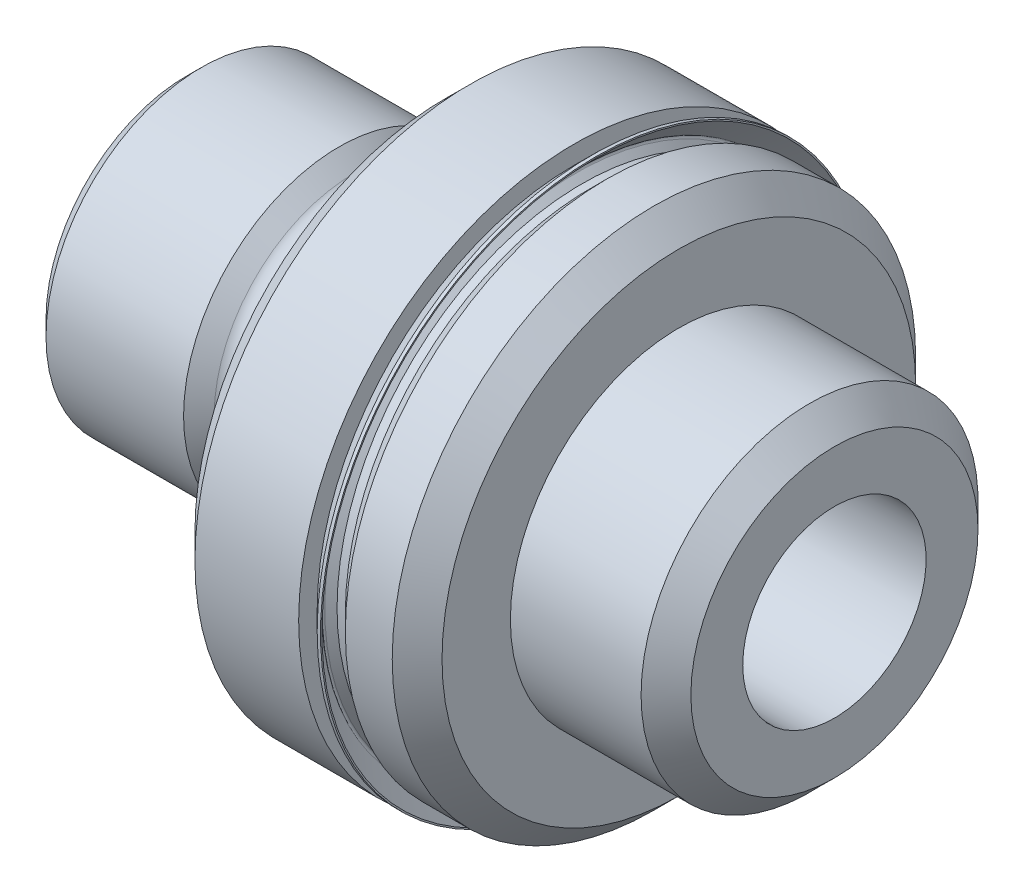
ISO-10303-21;
HEADER;
FILE_DESCRIPTION(('STEP AP214'),'2;1');
FILE_NAME('part.step','',(''),(''),'','','');
FILE_SCHEMA(('AUTOMOTIVE_DESIGN { 1 0 10303 214 1 1 1 1 }'));
ENDSEC;
DATA;
#1=APPLICATION_CONTEXT('core data for automotive mechanical design processes');
#2=APPLICATION_PROTOCOL_DEFINITION('international standard','automotive_design',2000,#1);
#3=PRODUCT_CONTEXT('',#1,'mechanical');
#4=PRODUCT('Part','Part','',(#3));
#5=PRODUCT_RELATED_PRODUCT_CATEGORY('part','',(#4));
#6=PRODUCT_DEFINITION_FORMATION('','',#4);
#7=PRODUCT_DEFINITION_CONTEXT('part definition',#1,'design');
#8=PRODUCT_DEFINITION('design','',#6,#7);
#9=PRODUCT_DEFINITION_SHAPE('','',#8);
#10=(LENGTH_UNIT() NAMED_UNIT(*) SI_UNIT(.MILLI.,.METRE.));
#11=(NAMED_UNIT(*) PLANE_ANGLE_UNIT() SI_UNIT($,.RADIAN.));
#12=(NAMED_UNIT(*) SI_UNIT($,.STERADIAN.) SOLID_ANGLE_UNIT());
#13=UNCERTAINTY_MEASURE_WITH_UNIT(LENGTH_MEASURE(1.E-05),#10,'distance_accuracy_value','');
#14=(GEOMETRIC_REPRESENTATION_CONTEXT(3) GLOBAL_UNCERTAINTY_ASSIGNED_CONTEXT((#13)) GLOBAL_UNIT_ASSIGNED_CONTEXT((#10,
#11,#12)) REPRESENTATION_CONTEXT('',''));
#15=CARTESIAN_POINT('',(0.,0.,0.));
#16=DIRECTION('',(0.,0.,1.));
#17=DIRECTION('',(1.,0.,0.));
#18=AXIS2_PLACEMENT_3D('',#15,#16,#17);
#19=CARTESIAN_POINT('',(23.7236,16.84655,0.));
#20=DIRECTION('',(-1.,0.,0.));
#21=DIRECTION('',(0.,0.,1.));
#22=AXIS2_PLACEMENT_3D('',#19,#20,#21);
#23=PLANE('',#22);
#24=CARTESIAN_POINT('',(23.7236,0.,0.));
#25=DIRECTION('',(-1.,0.,0.));
#26=DIRECTION('',(0.,0.,1.));
#27=AXIS2_PLACEMENT_3D('',#24,#25,#26);
#28=CIRCLE('',#27,16.84655);
#29=CARTESIAN_POINT('',(23.7236,0.,16.84655));
#30=VERTEX_POINT('',#29);
#31=EDGE_CURVE('E85',#30,#30,#28,.T.);
#32=ORIENTED_EDGE('',*,*,#31,.F.);
#33=EDGE_LOOP('',(#32));
#34=FACE_BOUND('',#33,.T.);
#35=CARTESIAN_POINT('',(23.7236,-2.74838938549352E-13,1.61870165610332E-13));
#36=DIRECTION('',(-1.,0.,0.));
#37=DIRECTION('',(0.,0.,1.));
#38=AXIS2_PLACEMENT_3D('',#35,#36,#37);
#39=CIRCLE('',#38,15.7132591752454);
#40=CARTESIAN_POINT('',(23.7236,-2.74838938549352E-13,15.7132591752456));
#41=VERTEX_POINT('',#40);
#42=EDGE_CURVE('E10',#41,#41,#39,.F.);
#43=ORIENTED_EDGE('',*,*,#42,.F.);
#44=EDGE_LOOP('',(#43));
#45=FACE_BOUND('',#44,.T.);
#46=ADVANCED_FACE('F35',(#34,#45),#23,.F.);
#47=CARTESIAN_POINT('',(30.1498,0.,0.));
#48=DIRECTION('',(-1.,0.,0.));
#49=DIRECTION('',(0.,0.,1.));
#50=AXIS2_PLACEMENT_3D('',#47,#48,#49);
#51=CYLINDRICAL_SURFACE('',#50,15.00505);
#52=CARTESIAN_POINT('',(24.7396,0.,0.));
#53=DIRECTION('',(-1.,0.,0.));
#54=DIRECTION('',(0.,0.,1.));
#55=AXIS2_PLACEMENT_3D('',#52,#53,#54);
#56=CIRCLE('',#55,15.00505);
#57=CARTESIAN_POINT('',(24.7396,0.,15.00505));
#58=VERTEX_POINT('',#57);
#59=EDGE_CURVE('E88',#58,#58,#56,.T.);
#60=ORIENTED_EDGE('',*,*,#59,.T.);
#61=EDGE_LOOP('',(#60));
#62=FACE_BOUND('',#61,.T.);
#63=CARTESIAN_POINT('',(24.2316000000001,-2.67896815842051E-13,0.));
#64=DIRECTION('',(-1.,0.,0.));
#65=DIRECTION('',(0.,-1.,0.));
#66=AXIS2_PLACEMENT_3D('',#63,#64,#65);
#67=CIRCLE('',#66,15.00505);
#68=CARTESIAN_POINT('',(24.2315999999999,-15.0050500000003,0.));
#69=VERTEX_POINT('',#68);
#70=EDGE_CURVE('E42',#69,#69,#67,.T.);
#71=ORIENTED_EDGE('',*,*,#70,.F.);
#72=EDGE_LOOP('',(#71));
#73=FACE_BOUND('',#72,.T.);
#74=ADVANCED_FACE('F143',(#62,#73),#51,.T.);
#75=CARTESIAN_POINT('',(30.1498,14.49705,0.));
#76=DIRECTION('',(-1.,0.,0.));
#77=DIRECTION('',(0.,0.,1.));
#78=AXIS2_PLACEMENT_3D('',#75,#76,#77);
#79=PLANE('',#78);
#80=CARTESIAN_POINT('',(30.1498,0.,0.));
#81=DIRECTION('',(-1.,0.,0.));
#82=DIRECTION('',(0.,0.,1.));
#83=AXIS2_PLACEMENT_3D('',#80,#81,#82);
#84=CIRCLE('',#83,14.49705);
#85=CARTESIAN_POINT('',(30.1498,0.,14.49705));
#86=VERTEX_POINT('',#85);
#87=EDGE_CURVE('E97',#86,#86,#84,.T.);
#88=ORIENTED_EDGE('',*,*,#87,.F.);
#89=EDGE_LOOP('',(#88));
#90=FACE_BOUND('',#89,.T.);
#91=CARTESIAN_POINT('',(30.1498,0.,0.));
#92=DIRECTION('',(-1.,0.,0.));
#93=DIRECTION('',(0.,0.,1.));
#94=AXIS2_PLACEMENT_3D('',#91,#92,#93);
#95=CIRCLE('',#94,10.3124);
#96=CARTESIAN_POINT('',(30.1498,0.,10.3124));
#97=VERTEX_POINT('',#96);
#98=EDGE_CURVE('E46',#97,#97,#95,.F.);
#99=ORIENTED_EDGE('',*,*,#98,.F.);
#100=EDGE_LOOP('',(#99));
#101=FACE_BOUND('',#100,.T.);
#102=ADVANCED_FACE('F149',(#90,#101),#79,.F.);
#103=CARTESIAN_POINT('',(15.8496,0.,0.));
#104=DIRECTION('',(-1.,0.,0.));
#105=DIRECTION('',(0.,0.,1.));
#106=AXIS2_PLACEMENT_3D('',#103,#104,#105);
#107=CYLINDRICAL_SURFACE('',#106,9.49325);
#108=CARTESIAN_POINT('',(13.462,0.,0.));
#109=DIRECTION('',(-1.,0.,0.));
#110=DIRECTION('',(0.,0.,1.));
#111=AXIS2_PLACEMENT_3D('',#108,#109,#110);
#112=CIRCLE('',#111,9.49325);
#113=CARTESIAN_POINT('',(13.462,0.,9.49325));
#114=VERTEX_POINT('',#113);
#115=EDGE_CURVE('E50',#114,#114,#112,.T.);
#116=ORIENTED_EDGE('',*,*,#115,.F.);
#117=EDGE_LOOP('',(#116));
#118=FACE_BOUND('',#117,.T.);
#119=CARTESIAN_POINT('',(15.8496,0.,0.));
#120=DIRECTION('',(1.,0.,0.));
#121=DIRECTION('',(0.,0.,-1.));
#122=AXIS2_PLACEMENT_3D('',#119,#120,#121);
#123=CIRCLE('',#122,9.49325);
#124=CARTESIAN_POINT('',(15.8496,0.,-9.49325));
#125=VERTEX_POINT('',#124);
#126=EDGE_CURVE('E76',#125,#125,#123,.T.);
#127=ORIENTED_EDGE('',*,*,#126,.F.);
#128=EDGE_LOOP('',(#127));
#129=FACE_BOUND('',#128,.T.);
#130=ADVANCED_FACE('F37',(#118,#129),#107,.T.);
#131=CARTESIAN_POINT('',(13.462,9.31544999999926,0.));
#132=DIRECTION('',(1.,0.,0.));
#133=DIRECTION('',(0.,0.,-1.));
#134=AXIS2_PLACEMENT_3D('',#131,#132,#133);
#135=PLANE('',#134);
#136=CARTESIAN_POINT('',(13.462,0.,0.));
#137=DIRECTION('',(-1.,0.,0.));
#138=DIRECTION('',(0.,0.,1.));
#139=AXIS2_PLACEMENT_3D('',#136,#137,#138);
#140=CIRCLE('',#139,9.31544999999926);
#141=CARTESIAN_POINT('',(13.462,0.,9.31544999999926));
#142=VERTEX_POINT('',#141);
#143=EDGE_CURVE('E55',#142,#142,#140,.T.);
#144=ORIENTED_EDGE('',*,*,#143,.F.);
#145=EDGE_LOOP('',(#144));
#146=FACE_BOUND('',#145,.T.);
#147=ORIENTED_EDGE('',*,*,#115,.T.);
#148=EDGE_LOOP('',(#147));
#149=FACE_BOUND('',#148,.T.);
#150=ADVANCED_FACE('F195',(#146,#149),#135,.F.);
#151=CARTESIAN_POINT('',(12.4460000000007,0.,0.));
#152=DIRECTION('',(-1.,0.,0.));
#153=DIRECTION('',(0.,0.,1.));
#154=AXIS2_PLACEMENT_3D('',#151,#152,#153);
#155=TOROIDAL_SURFACE('',#154,9.31544999999926,1.01599999999926);
#156=CARTESIAN_POINT('',(12.4460000000007,0.,0.));
#157=DIRECTION('',(-1.,0.,0.));
#158=DIRECTION('',(0.,0.,1.));
#159=AXIS2_PLACEMENT_3D('',#156,#157,#158);
#160=CIRCLE('',#159,8.29945);
#161=CARTESIAN_POINT('',(12.4460000000007,0.,8.29945));
#162=VERTEX_POINT('',#161);
#163=EDGE_CURVE('E58',#162,#162,#160,.T.);
#164=ORIENTED_EDGE('',*,*,#163,.F.);
#165=EDGE_LOOP('',(#164));
#166=FACE_BOUND('',#165,.T.);
#167=ORIENTED_EDGE('',*,*,#143,.T.);
#168=EDGE_LOOP('',(#167));
#169=FACE_BOUND('',#168,.T.);
#170=ADVANCED_FACE('F192',(#166,#169),#155,.F.);
#171=CARTESIAN_POINT('',(15.8496,0.,0.));
#172=DIRECTION('',(-1.,0.,0.));
#173=DIRECTION('',(0.,0.,1.));
#174=AXIS2_PLACEMENT_3D('',#171,#172,#173);
#175=CYLINDRICAL_SURFACE('',#174,8.29945);
#176=CARTESIAN_POINT('',(11.0109,0.,0.));
#177=DIRECTION('',(-1.,0.,0.));
#178=DIRECTION('',(0.,0.,1.));
#179=AXIS2_PLACEMENT_3D('',#176,#177,#178);
#180=CIRCLE('',#179,8.29945);
#181=CARTESIAN_POINT('',(11.0109,0.,8.29945));
#182=VERTEX_POINT('',#181);
#183=EDGE_CURVE('E61',#182,#182,#180,.T.);
#184=ORIENTED_EDGE('',*,*,#183,.F.);
#185=EDGE_LOOP('',(#184));
#186=FACE_BOUND('',#185,.T.);
#187=ORIENTED_EDGE('',*,*,#163,.T.);
#188=EDGE_LOOP('',(#187));
#189=FACE_BOUND('',#188,.T.);
#190=ADVANCED_FACE('F188',(#186,#189),#175,.T.);
#191=CARTESIAN_POINT('',(11.0109000000002,0.,0.));
#192=DIRECTION('',(-1.,0.,0.));
#193=DIRECTION('',(0.,0.,1.));
#194=AXIS2_PLACEMENT_3D('',#191,#192,#193);
#195=TOROIDAL_SURFACE('',#194,9.31544999999971,1.01599999999971);
#196=CARTESIAN_POINT('',(10.2955719352921,0.,0.));
#197=DIRECTION('',(-1.,0.,0.));
#198=DIRECTION('',(0.,0.,1.));
#199=AXIS2_PLACEMENT_3D('',#196,#197,#198);
#200=CIRCLE('',#199,8.59395033968067);
#201=CARTESIAN_POINT('',(10.2955719352921,0.,8.59395033968067));
#202=VERTEX_POINT('',#201);
#203=EDGE_CURVE('E64',#202,#202,#200,.T.);
#204=ORIENTED_EDGE('',*,*,#203,.F.);
#205=EDGE_LOOP('',(#204));
#206=FACE_BOUND('',#205,.T.);
#207=ORIENTED_EDGE('',*,*,#183,.T.);
#208=EDGE_LOOP('',(#207));
#209=FACE_BOUND('',#208,.T.);
#210=ADVANCED_FACE('F184',(#206,#209),#195,.F.);
#211=CARTESIAN_POINT('',(10.2955719352921,0.,0.));
#212=DIRECTION('',(-1.,0.,0.));
#213=DIRECTION('',(0.,0.,1.));
#214=AXIS2_PLACEMENT_3D('',#211,#212,#213);
#215=CONICAL_SURFACE('',#214,8.59395033968067,0.781102897131641);
#216=CARTESIAN_POINT('',(9.3564895103145,0.,0.));
#217=DIRECTION('',(-1.,0.,0.));
#218=DIRECTION('',(0.,0.,1.));
#219=AXIS2_PLACEMENT_3D('',#216,#217,#218);
#220=CIRCLE('',#219,9.525);
#221=CARTESIAN_POINT('',(9.3564895103145,0.,9.525));
#222=VERTEX_POINT('',#221);
#223=EDGE_CURVE('E67',#222,#222,#220,.T.);
#224=ORIENTED_EDGE('',*,*,#223,.F.);
#225=EDGE_LOOP('',(#224));
#226=FACE_BOUND('',#225,.T.);
#227=ORIENTED_EDGE('',*,*,#203,.T.);
#228=EDGE_LOOP('',(#227));
#229=FACE_BOUND('',#228,.T.);
#230=ADVANCED_FACE('F180',(#226,#229),#215,.T.);
#231=CARTESIAN_POINT('',(15.8496,0.,0.));
#232=DIRECTION('',(-1.,0.,0.));
#233=DIRECTION('',(0.,0.,1.));
#234=AXIS2_PLACEMENT_3D('',#231,#232,#233);
#235=CYLINDRICAL_SURFACE('',#234,9.525);
#236=CARTESIAN_POINT('',(0.935989999999999,0.,0.));
#237=DIRECTION('',(-1.,0.,0.));
#238=DIRECTION('',(0.,0.,1.));
#239=AXIS2_PLACEMENT_3D('',#236,#237,#238);
#240=CIRCLE('',#239,9.525);
#241=CARTESIAN_POINT('',(0.935989999999999,0.,9.525));
#242=VERTEX_POINT('',#241);
#243=EDGE_CURVE('E70',#242,#242,#240,.T.);
#244=ORIENTED_EDGE('',*,*,#243,.F.);
#245=EDGE_LOOP('',(#244));
#246=FACE_BOUND('',#245,.T.);
#247=ORIENTED_EDGE('',*,*,#223,.T.);
#248=EDGE_LOOP('',(#247));
#249=FACE_BOUND('',#248,.T.);
#250=ADVANCED_FACE('F176',(#246,#249),#235,.T.);
#251=CARTESIAN_POINT('',(0.935989999999999,0.,0.));
#252=DIRECTION('',(1.,0.,0.));
#253=DIRECTION('',(0.,0.,-1.));
#254=AXIS2_PLACEMENT_3D('',#251,#252,#253);
#255=CONICAL_SURFACE('',#254,9.525,0.785398163397449);
#256=CARTESIAN_POINT('',(0.,0.,0.));
#257=DIRECTION('',(-1.,0.,0.));
#258=DIRECTION('',(0.,0.,1.));
#259=AXIS2_PLACEMENT_3D('',#256,#257,#258);
#260=CIRCLE('',#259,8.58901);
#261=CARTESIAN_POINT('',(0.,0.,8.58901));
#262=VERTEX_POINT('',#261);
#263=EDGE_CURVE('E73',#262,#262,#260,.T.);
#264=ORIENTED_EDGE('',*,*,#263,.F.);
#265=EDGE_LOOP('',(#264));
#266=FACE_BOUND('',#265,.T.);
#267=ORIENTED_EDGE('',*,*,#243,.T.);
#268=EDGE_LOOP('',(#267));
#269=FACE_BOUND('',#268,.T.);
#270=ADVANCED_FACE('F172',(#266,#269),#255,.T.);
#271=CARTESIAN_POINT('',(0.,0.,0.));
#272=DIRECTION('',(1.,0.,0.));
#273=DIRECTION('',(0.,0.,-1.));
#274=AXIS2_PLACEMENT_3D('',#271,#272,#273);
#275=PLANE('',#274);
#276=CARTESIAN_POINT('',(0.,0.,0.));
#277=DIRECTION('',(-1.,0.,0.));
#278=DIRECTION('',(0.,0.,1.));
#279=AXIS2_PLACEMENT_3D('',#276,#277,#278);
#280=CIRCLE('',#279,6.3754);
#281=CARTESIAN_POINT('',(0.,0.,6.3754));
#282=VERTEX_POINT('',#281);
#283=EDGE_CURVE('E112',#282,#282,#280,.T.);
#284=ORIENTED_EDGE('',*,*,#283,.F.);
#285=EDGE_LOOP('',(#284));
#286=FACE_BOUND('',#285,.T.);
#287=ORIENTED_EDGE('',*,*,#263,.T.);
#288=EDGE_LOOP('',(#287));
#289=FACE_BOUND('',#288,.T.);
#290=ADVANCED_FACE('F168',(#286,#289),#275,.F.);
#291=CARTESIAN_POINT('',(15.8496,0.,0.));
#292=DIRECTION('',(1.,0.,0.));
#293=DIRECTION('',(0.,0.,-1.));
#294=AXIS2_PLACEMENT_3D('',#291,#292,#293);
#295=PLANE('',#294);
#296=CARTESIAN_POINT('',(15.8496,0.,0.));
#297=DIRECTION('',(-1.,0.,0.));
#298=DIRECTION('',(0.,0.,1.));
#299=AXIS2_PLACEMENT_3D('',#296,#297,#298);
#300=CIRCLE('',#299,15.32255);
#301=CARTESIAN_POINT('',(15.8496,0.,15.32255));
#302=VERTEX_POINT('',#301);
#303=EDGE_CURVE('E79',#302,#302,#300,.T.);
#304=ORIENTED_EDGE('',*,*,#303,.T.);
#305=EDGE_LOOP('',(#304));
#306=FACE_BOUND('',#305,.T.);
#307=ORIENTED_EDGE('',*,*,#126,.T.);
#308=EDGE_LOOP('',(#307));
#309=FACE_BOUND('',#308,.T.);
#310=ADVANCED_FACE('F164',(#306,#309),#295,.F.);
#311=CARTESIAN_POINT('',(17.3736,0.,0.));
#312=DIRECTION('',(1.,0.,0.));
#313=DIRECTION('',(0.,0.,-1.));
#314=AXIS2_PLACEMENT_3D('',#311,#312,#313);
#315=CONICAL_SURFACE('',#314,16.84655,0.78539816339745);
#316=ORIENTED_EDGE('',*,*,#303,.F.);
#317=EDGE_LOOP('',(#316));
#318=FACE_BOUND('',#317,.T.);
#319=CARTESIAN_POINT('',(17.3736,0.,0.));
#320=DIRECTION('',(-1.,0.,0.));
#321=DIRECTION('',(0.,0.,1.));
#322=AXIS2_PLACEMENT_3D('',#319,#320,#321);
#323=CIRCLE('',#322,16.84655);
#324=CARTESIAN_POINT('',(17.3736,0.,16.84655));
#325=VERTEX_POINT('',#324);
#326=EDGE_CURVE('E82',#325,#325,#323,.T.);
#327=ORIENTED_EDGE('',*,*,#326,.T.);
#328=EDGE_LOOP('',(#327));
#329=FACE_BOUND('',#328,.T.);
#330=ADVANCED_FACE('F160',(#318,#329),#315,.T.);
#331=CARTESIAN_POINT('',(30.1498,0.,0.));
#332=DIRECTION('',(-1.,0.,0.));
#333=DIRECTION('',(0.,0.,1.));
#334=AXIS2_PLACEMENT_3D('',#331,#332,#333);
#335=CYLINDRICAL_SURFACE('',#334,16.84655);
#336=ORIENTED_EDGE('',*,*,#326,.F.);
#337=EDGE_LOOP('',(#336));
#338=FACE_BOUND('',#337,.T.);
#339=ORIENTED_EDGE('',*,*,#31,.T.);
#340=EDGE_LOOP('',(#339));
#341=FACE_BOUND('',#340,.T.);
#342=ADVANCED_FACE('F156',(#338,#341),#335,.T.);
#343=CARTESIAN_POINT('',(25.7556,0.,0.));
#344=DIRECTION('',(1.,0.,0.));
#345=DIRECTION('',(0.,0.,-1.));
#346=AXIS2_PLACEMENT_3D('',#343,#344,#345);
#347=CONICAL_SURFACE('',#346,16.02105,0.785398163397448);
#348=ORIENTED_EDGE('',*,*,#59,.F.);
#349=EDGE_LOOP('',(#348));
#350=FACE_BOUND('',#349,.T.);
#351=CARTESIAN_POINT('',(25.7556,0.,0.));
#352=DIRECTION('',(-1.,0.,0.));
#353=DIRECTION('',(0.,0.,1.));
#354=AXIS2_PLACEMENT_3D('',#351,#352,#353);
#355=CIRCLE('',#354,16.02105);
#356=CARTESIAN_POINT('',(25.7556,0.,16.02105));
#357=VERTEX_POINT('',#356);
#358=EDGE_CURVE('E91',#357,#357,#355,.T.);
#359=ORIENTED_EDGE('',*,*,#358,.T.);
#360=EDGE_LOOP('',(#359));
#361=FACE_BOUND('',#360,.T.);
#362=ADVANCED_FACE('F159',(#350,#361),#347,.T.);
#363=CARTESIAN_POINT('',(30.1498,0.,0.));
#364=DIRECTION('',(-1.,0.,0.));
#365=DIRECTION('',(0.,0.,1.));
#366=AXIS2_PLACEMENT_3D('',#363,#364,#365);
#367=CYLINDRICAL_SURFACE('',#366,16.02105);
#368=ORIENTED_EDGE('',*,*,#358,.F.);
#369=EDGE_LOOP('',(#368));
#370=FACE_BOUND('',#369,.T.);
#371=CARTESIAN_POINT('',(28.6258,0.,0.));
#372=DIRECTION('',(-1.,0.,0.));
#373=DIRECTION('',(0.,0.,1.));
#374=AXIS2_PLACEMENT_3D('',#371,#372,#373);
#375=CIRCLE('',#374,16.02105);
#376=CARTESIAN_POINT('',(28.6258,0.,16.02105));
#377=VERTEX_POINT('',#376);
#378=EDGE_CURVE('E94',#377,#377,#375,.T.);
#379=ORIENTED_EDGE('',*,*,#378,.T.);
#380=EDGE_LOOP('',(#379));
#381=FACE_BOUND('',#380,.T.);
#382=ADVANCED_FACE('F226',(#370,#381),#367,.T.);
#383=CARTESIAN_POINT('',(30.1498,0.,0.));
#384=DIRECTION('',(-1.,0.,0.));
#385=DIRECTION('',(0.,0.,1.));
#386=AXIS2_PLACEMENT_3D('',#383,#384,#385);
#387=CONICAL_SURFACE('',#386,14.49705,0.785398163397448);
#388=ORIENTED_EDGE('',*,*,#378,.F.);
#389=EDGE_LOOP('',(#388));
#390=FACE_BOUND('',#389,.T.);
#391=ORIENTED_EDGE('',*,*,#87,.T.);
#392=EDGE_LOOP('',(#391));
#393=FACE_BOUND('',#392,.T.);
#394=ADVANCED_FACE('F223',(#390,#393),#387,.T.);
#395=CARTESIAN_POINT('',(39.6748,0.,0.));
#396=DIRECTION('',(-1.,0.,0.));
#397=DIRECTION('',(0.,0.,1.));
#398=AXIS2_PLACEMENT_3D('',#395,#396,#397);
#399=CYLINDRICAL_SURFACE('',#398,10.3124);
#400=ORIENTED_EDGE('',*,*,#98,.T.);
#401=EDGE_LOOP('',(#400));
#402=FACE_BOUND('',#401,.T.);
#403=CARTESIAN_POINT('',(38.1508,0.,0.));
#404=DIRECTION('',(-1.,0.,0.));
#405=DIRECTION('',(0.,0.,1.));
#406=AXIS2_PLACEMENT_3D('',#403,#404,#405);
#407=CIRCLE('',#406,10.3124);
#408=CARTESIAN_POINT('',(38.1508,0.,10.3124));
#409=VERTEX_POINT('',#408);
#410=EDGE_CURVE('E100',#409,#409,#407,.T.);
#411=ORIENTED_EDGE('',*,*,#410,.T.);
#412=EDGE_LOOP('',(#411));
#413=FACE_BOUND('',#412,.T.);
#414=ADVANCED_FACE('F221',(#402,#413),#399,.T.);
#415=CARTESIAN_POINT('',(39.6748,0.,0.));
#416=DIRECTION('',(-1.,0.,0.));
#417=DIRECTION('',(0.,0.,1.));
#418=AXIS2_PLACEMENT_3D('',#415,#416,#417);
#419=CONICAL_SURFACE('',#418,8.7884,0.78539816339745);
#420=ORIENTED_EDGE('',*,*,#410,.F.);
#421=EDGE_LOOP('',(#420));
#422=FACE_BOUND('',#421,.T.);
#423=CARTESIAN_POINT('',(39.6748,0.,0.));
#424=DIRECTION('',(-1.,0.,0.));
#425=DIRECTION('',(0.,0.,1.));
#426=AXIS2_PLACEMENT_3D('',#423,#424,#425);
#427=CIRCLE('',#426,8.7884);
#428=CARTESIAN_POINT('',(39.6748,0.,8.7884));
#429=VERTEX_POINT('',#428);
#430=EDGE_CURVE('E103',#429,#429,#427,.T.);
#431=ORIENTED_EDGE('',*,*,#430,.T.);
#432=EDGE_LOOP('',(#431));
#433=FACE_BOUND('',#432,.T.);
#434=ADVANCED_FACE('F261',(#422,#433),#419,.T.);
#435=CARTESIAN_POINT('',(39.6748,8.7884,0.));
#436=DIRECTION('',(-1.,0.,0.));
#437=DIRECTION('',(0.,0.,1.));
#438=AXIS2_PLACEMENT_3D('',#435,#436,#437);
#439=PLANE('',#438);
#440=CARTESIAN_POINT('',(39.6748,0.,0.));
#441=DIRECTION('',(-1.,0.,0.));
#442=DIRECTION('',(0.,0.,1.));
#443=AXIS2_PLACEMENT_3D('',#440,#441,#442);
#444=CIRCLE('',#443,5.6134);
#445=CARTESIAN_POINT('',(39.6748,0.,5.6134));
#446=VERTEX_POINT('',#445);
#447=EDGE_CURVE('E106',#446,#446,#444,.T.);
#448=ORIENTED_EDGE('',*,*,#447,.T.);
#449=EDGE_LOOP('',(#448));
#450=FACE_BOUND('',#449,.T.);
#451=ORIENTED_EDGE('',*,*,#430,.F.);
#452=EDGE_LOOP('',(#451));
#453=FACE_BOUND('',#452,.T.);
#454=ADVANCED_FACE('F269',(#450,#453),#439,.F.);
#455=CARTESIAN_POINT('',(0.,0.,0.));
#456=DIRECTION('',(-1.,0.,0.));
#457=DIRECTION('',(0.,0.,1.));
#458=AXIS2_PLACEMENT_3D('',#455,#456,#457);
#459=CYLINDRICAL_SURFACE('',#458,5.6134);
#460=ORIENTED_EDGE('',*,*,#447,.F.);
#461=EDGE_LOOP('',(#460));
#462=FACE_BOUND('',#461,.T.);
#463=CARTESIAN_POINT('',(0.761999999999992,0.,0.));
#464=DIRECTION('',(-1.,0.,0.));
#465=DIRECTION('',(0.,0.,1.));
#466=AXIS2_PLACEMENT_3D('',#463,#464,#465);
#467=CIRCLE('',#466,5.61340000000001);
#468=CARTESIAN_POINT('',(0.761999999999992,0.,5.61340000000001));
#469=VERTEX_POINT('',#468);
#470=EDGE_CURVE('E109',#469,#469,#467,.T.);
#471=ORIENTED_EDGE('',*,*,#470,.T.);
#472=EDGE_LOOP('',(#471));
#473=FACE_BOUND('',#472,.T.);
#474=ADVANCED_FACE('F276',(#462,#473),#459,.F.);
#475=CARTESIAN_POINT('',(0.,0.,0.));
#476=DIRECTION('',(-1.,0.,0.));
#477=DIRECTION('',(0.,0.,1.));
#478=AXIS2_PLACEMENT_3D('',#475,#476,#477);
#479=CONICAL_SURFACE('',#478,6.3754,0.785398163397449);
#480=ORIENTED_EDGE('',*,*,#470,.F.);
#481=EDGE_LOOP('',(#480));
#482=FACE_BOUND('',#481,.T.);
#483=ORIENTED_EDGE('',*,*,#283,.T.);
#484=EDGE_LOOP('',(#483));
#485=FACE_BOUND('',#484,.T.);
#486=ADVANCED_FACE('F285',(#482,#485),#479,.F.);
#487=CARTESIAN_POINT('',(24.8568908247548,-2.74838938549352E-13,0.));
#488=DIRECTION('',(1.,0.,0.));
#489=DIRECTION('',(0.,1.,0.));
#490=AXIS2_PLACEMENT_3D('',#487,#488,#489);
#491=CONICAL_SURFACE('',#490,16.8465500000003,0.785398163397461);
#492=ORIENTED_EDGE('',*,*,#42,.T.);
#493=EDGE_LOOP('',(#492));
#494=FACE_BOUND('',#493,.T.);
#495=CARTESIAN_POINT('',(24.8568908247548,-2.74838938549352E-13,0.));
#496=DIRECTION('',(-1.,0.,0.));
#497=DIRECTION('',(0.,-1.,0.));
#498=AXIS2_PLACEMENT_3D('',#495,#496,#497);
#499=CIRCLE('',#498,16.8465500000003);
#500=CARTESIAN_POINT('',(24.8568908247546,-16.8465500000006,0.));
#501=VERTEX_POINT('',#500);
#502=EDGE_CURVE('E115',#501,#501,#499,.T.);
#503=ORIENTED_EDGE('',*,*,#502,.T.);
#504=EDGE_LOOP('',(#503));
#505=FACE_BOUND('',#504,.T.);
#506=ADVANCED_FACE('F293',(#494,#505),#491,.T.);
#507=CARTESIAN_POINT('',(24.7396,-2.7353674880715E-13,0.));
#508=DIRECTION('',(-1.,0.,0.));
#509=DIRECTION('',(0.,-1.,0.));
#510=AXIS2_PLACEMENT_3D('',#507,#508,#509);
#511=CYLINDRICAL_SURFACE('',#510,16.8465500000003);
#512=ORIENTED_EDGE('',*,*,#502,.F.);
#513=EDGE_LOOP('',(#512));
#514=FACE_BOUND('',#513,.T.);
#515=CARTESIAN_POINT('',(25.0600908247548,-2.77094911735392E-13,0.));
#516=DIRECTION('',(-1.,0.,0.));
#517=DIRECTION('',(0.,-1.,0.));
#518=AXIS2_PLACEMENT_3D('',#515,#516,#517);
#519=CIRCLE('',#518,16.8465500000003);
#520=CARTESIAN_POINT('',(25.0600908247546,-16.8465500000006,0.));
#521=VERTEX_POINT('',#520);
#522=EDGE_CURVE('E118',#521,#521,#519,.T.);
#523=ORIENTED_EDGE('',*,*,#522,.T.);
#524=EDGE_LOOP('',(#523));
#525=FACE_BOUND('',#524,.T.);
#526=ADVANCED_FACE('F300',(#514,#525),#511,.T.);
#527=CARTESIAN_POINT('',(25.060090824755,16.762381804126,0.));
#528=DIRECTION('',(-1.,0.,0.));
#529=DIRECTION('',(0.,-1.,0.));
#530=AXIS2_PLACEMENT_3D('',#527,#528,#529);
#531=PLANE('',#530);
#532=ORIENTED_EDGE('',*,*,#522,.F.);
#533=EDGE_LOOP('',(#532));
#534=FACE_BOUND('',#533,.T.);
#535=CARTESIAN_POINT('',(25.0600908247548,-2.77094911735392E-13,0.));
#536=DIRECTION('',(-1.,0.,0.));
#537=DIRECTION('',(0.,-1.,0.));
#538=AXIS2_PLACEMENT_3D('',#535,#536,#537);
#539=CIRCLE('',#538,16.7623818041263);
#540=CARTESIAN_POINT('',(25.0600908247546,-16.7623818041266,0.));
#541=VERTEX_POINT('',#540);
#542=EDGE_CURVE('E121',#541,#541,#539,.T.);
#543=ORIENTED_EDGE('',*,*,#542,.T.);
#544=EDGE_LOOP('',(#543));
#545=FACE_BOUND('',#544,.T.);
#546=ADVANCED_FACE('F308',(#534,#545),#531,.F.);
#547=CARTESIAN_POINT('',(23.8569820715252,-2.63737721345746E-13,0.));
#548=DIRECTION('',(1.,0.,0.));
#549=DIRECTION('',(0.,1.,0.));
#550=AXIS2_PLACEMENT_3D('',#547,#548,#549);
#551=CONICAL_SURFACE('',#550,15.5592730508967,0.785398163397461);
#552=ORIENTED_EDGE('',*,*,#542,.F.);
#553=EDGE_LOOP('',(#552));
#554=FACE_BOUND('',#553,.T.);
#555=CARTESIAN_POINT('',(23.8569820715252,-2.63737721345746E-13,0.));
#556=DIRECTION('',(-1.,0.,0.));
#557=DIRECTION('',(0.,-1.,0.));
#558=AXIS2_PLACEMENT_3D('',#555,#556,#557);
#559=CIRCLE('',#558,15.5592730508967);
#560=CARTESIAN_POINT('',(23.856982071525,-15.5592730508969,0.));
#561=VERTEX_POINT('',#560);
#562=EDGE_CURVE('E124',#561,#561,#559,.T.);
#563=ORIENTED_EDGE('',*,*,#562,.T.);
#564=EDGE_LOOP('',(#563));
#565=FACE_BOUND('',#564,.T.);
#566=ADVANCED_FACE('F139',(#554,#565),#551,.F.);
#567=CARTESIAN_POINT('',(23.9467846327361,-2.65412691824451E-13,0.));
#568=DIRECTION('',(-1.,0.,0.));
#569=DIRECTION('',(0.,-1.,0.));
#570=AXIS2_PLACEMENT_3D('',#567,#568,#569);
#571=TOROIDAL_SURFACE('',#570,15.4694704896858,0.127000000000283);
#572=ORIENTED_EDGE('',*,*,#562,.F.);
#573=EDGE_LOOP('',(#572));
#574=FACE_BOUND('',#573,.T.);
#575=CARTESIAN_POINT('',(23.8569820715252,-2.63737721345746E-13,0.));
#576=DIRECTION('',(-1.,0.,0.));
#577=DIRECTION('',(0.,-1.,0.));
#578=AXIS2_PLACEMENT_3D('',#575,#576,#577);
#579=CIRCLE('',#578,15.3796679284749);
#580=CARTESIAN_POINT('',(23.856982071525,-15.3796679284751,0.));
#581=VERTEX_POINT('',#580);
#582=EDGE_CURVE('E127',#581,#581,#579,.T.);
#583=ORIENTED_EDGE('',*,*,#582,.T.);
#584=EDGE_LOOP('',(#583));
#585=FACE_BOUND('',#584,.T.);
#586=ADVANCED_FACE('F131',(#574,#585),#571,.F.);
#587=CARTESIAN_POINT('',(24.2315999999998,-2.67896815842048E-13,0.));
#588=DIRECTION('',(-1.,0.,0.));
#589=DIRECTION('',(0.,-1.,0.));
#590=AXIS2_PLACEMENT_3D('',#587,#588,#589);
#591=CONICAL_SURFACE('',#590,15.0050500000003,0.785398163397432);
#592=ORIENTED_EDGE('',*,*,#582,.F.);
#593=EDGE_LOOP('',(#592));
#594=FACE_BOUND('',#593,.T.);
#595=ORIENTED_EDGE('',*,*,#70,.T.);
#596=EDGE_LOOP('',(#595));
#597=FACE_BOUND('',#596,.T.);
#598=ADVANCED_FACE('F133',(#594,#597),#591,.T.);
#599=CLOSED_SHELL('',(#46,#74,#102,#130,#150,#170,#190,#210,#230,#250,#270,#290,#310,#330,#342,
#362,#382,#394,#414,#434,#454,#474,#486,#506,#526,#546,#566,#586,#598));
#600=MANIFOLD_SOLID_BREP('B2',#599);
#601=ADVANCED_BREP_SHAPE_REPRESENTATION('',(#18,#600),#14);
#602=SHAPE_DEFINITION_REPRESENTATION(#9,#601);
ENDSEC;
END-ISO-10303-21;
